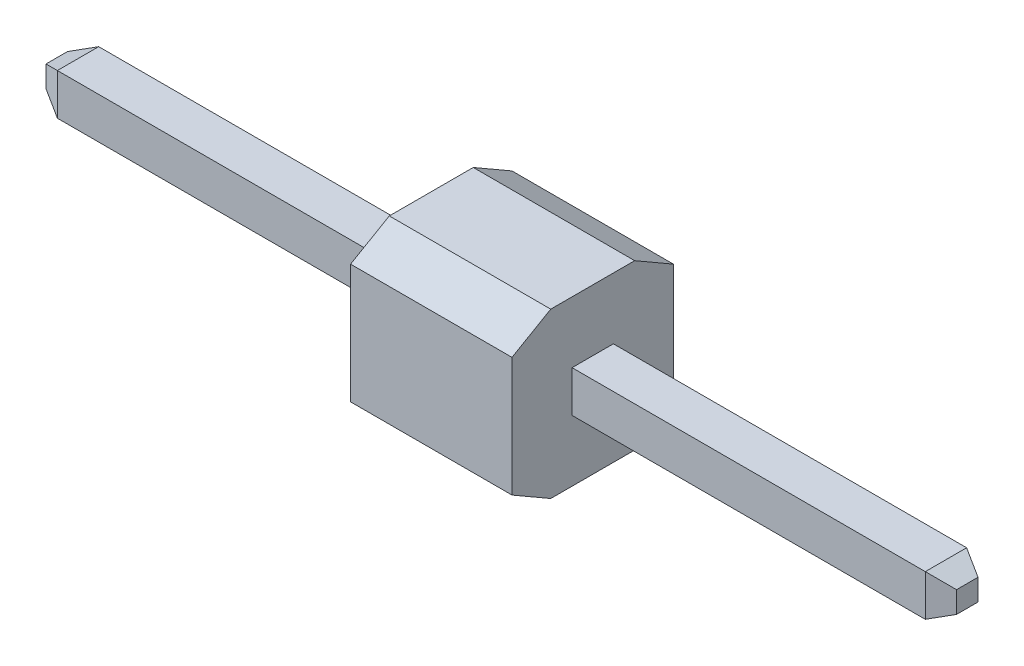
ISO-10303-21;
HEADER;
FILE_DESCRIPTION(('STEP AP214'),'2;1');
FILE_NAME('part.step','',(''),(''),'','','');
FILE_SCHEMA(('AUTOMOTIVE_DESIGN { 1 0 10303 214 1 1 1 1 }'));
ENDSEC;
DATA;
#1=APPLICATION_CONTEXT('core data for automotive mechanical design processes');
#2=APPLICATION_PROTOCOL_DEFINITION('international standard','automotive_design',2000,#1);
#3=PRODUCT_CONTEXT('',#1,'mechanical');
#4=PRODUCT('Part','Part','',(#3));
#5=PRODUCT_RELATED_PRODUCT_CATEGORY('part','',(#4));
#6=PRODUCT_DEFINITION_FORMATION('','',#4);
#7=PRODUCT_DEFINITION_CONTEXT('part definition',#1,'design');
#8=PRODUCT_DEFINITION('design','',#6,#7);
#9=PRODUCT_DEFINITION_SHAPE('','',#8);
#10=(LENGTH_UNIT() NAMED_UNIT(*) SI_UNIT(.MILLI.,.METRE.));
#11=(NAMED_UNIT(*) PLANE_ANGLE_UNIT() SI_UNIT($,.RADIAN.));
#12=(NAMED_UNIT(*) SI_UNIT($,.STERADIAN.) SOLID_ANGLE_UNIT());
#13=UNCERTAINTY_MEASURE_WITH_UNIT(LENGTH_MEASURE(1.E-05),#10,'distance_accuracy_value','');
#14=(GEOMETRIC_REPRESENTATION_CONTEXT(3) GLOBAL_UNCERTAINTY_ASSIGNED_CONTEXT((#13)) GLOBAL_UNIT_ASSIGNED_CONTEXT((#10,
#11,#12)) REPRESENTATION_CONTEXT('',''));
#15=CARTESIAN_POINT('',(0.,0.,0.));
#16=DIRECTION('',(0.,0.,1.));
#17=DIRECTION('',(1.,0.,0.));
#18=AXIS2_PLACEMENT_3D('',#15,#16,#17);
#19=CARTESIAN_POINT('',(5.42107483451908,2.22287173708609,0.629998634255617));
#20=DIRECTION('',(1.,4.37113882867379E-08,-4.37113882867379E-08));
#21=DIRECTION('',(-4.37113882867379E-08,1.,0.));
#22=AXIS2_PLACEMENT_3D('',#19,#20,#21);
#23=PLANE('',#22);
#24=DIRECTION('',(1.59994790123753E-08,0.500000000000193,0.866025403784327));
#25=VECTOR('',#24,1.);
#26=CARTESIAN_POINT('',(5.42107471153316,3.46646157557208,-0.940001365744382));
#27=LINE('',#26,#25);
#28=CARTESIAN_POINT('',(5.42107471153316,3.46646157557208,-0.940001365744382));
#29=VERTEX_POINT('',#28);
#30=CARTESIAN_POINT('',(5.42107472261793,3.81287173708609,-0.340001365744383));
#31=VERTEX_POINT('',#30);
#32=EDGE_CURVE('E11',#29,#31,#27,.T.);
#33=ORIENTED_EDGE('',*,*,#32,.T.);
#34=DIRECTION('',(4.37113880134522E-08,0.,0.999999999999999));
#35=VECTOR('',#34,1.);
#36=CARTESIAN_POINT('',(5.42107472261793,3.81287173708609,-0.340001365744383));
#37=LINE('',#36,#35);
#38=CARTESIAN_POINT('',(5.42107477944273,3.81287173708609,0.959998634255618));
#39=VERTEX_POINT('',#38);
#40=EDGE_CURVE('E304',#31,#39,#37,.T.);
#41=ORIENTED_EDGE('',*,*,#40,.T.);
#42=DIRECTION('',(5.97108668824037E-08,-0.500000000000186,0.866025403784329));
#43=VECTOR('',#42,1.);
#44=CARTESIAN_POINT('',(5.42107477944273,3.81287173708609,0.959998634255618));
#45=LINE('',#44,#43);
#46=CARTESIAN_POINT('',(5.42107482081163,3.46646157557209,1.55999863425562));
#47=VERTEX_POINT('',#46);
#48=EDGE_CURVE('E296',#39,#47,#45,.T.);
#49=ORIENTED_EDGE('',*,*,#48,.T.);
#50=DIRECTION('',(4.37113884816491E-08,-0.999999999999999,0.));
#51=VECTOR('',#50,1.);
#52=CARTESIAN_POINT('',(5.42107482081163,3.46646157557209,1.55999863425562));
#53=LINE('',#52,#51);
#54=CARTESIAN_POINT('',(5.42107490155442,1.61928189860609,1.55999863425562));
#55=VERTEX_POINT('',#54);
#56=EDGE_CURVE('E281',#47,#55,#53,.T.);
#57=ORIENTED_EDGE('',*,*,#56,.T.);
#58=DIRECTION('',(1.5999479012306E-08,0.500000000000192,0.866025403784328));
#59=VECTOR('',#58,1.);
#60=CARTESIAN_POINT('',(5.42107489046966,1.27287173708609,0.959998634255618));
#61=LINE('',#60,#59);
#62=CARTESIAN_POINT('',(5.42107489046966,1.27287173708609,0.959998634255618));
#63=VERTEX_POINT('',#62);
#64=EDGE_CURVE('E265',#63,#55,#61,.T.);
#65=ORIENTED_EDGE('',*,*,#64,.F.);
#66=DIRECTION('',(4.37113886966664E-08,0.,0.999999999999999));
#67=VECTOR('',#66,1.);
#68=CARTESIAN_POINT('',(5.42107483364485,1.27287173708609,-0.340001365744383));
#69=LINE('',#68,#67);
#70=CARTESIAN_POINT('',(5.42107483364485,1.27287173708609,-0.340001365744383));
#71=VERTEX_POINT('',#70);
#72=EDGE_CURVE('E248',#71,#63,#69,.T.);
#73=ORIENTED_EDGE('',*,*,#72,.F.);
#74=DIRECTION('',(5.971086560017E-08,-0.500000000000187,0.866025403784329));
#75=VECTOR('',#74,1.);
#76=CARTESIAN_POINT('',(5.42107479227595,1.61928189860608,-0.940001365744382));
#77=LINE('',#76,#75);
#78=CARTESIAN_POINT('',(5.42107479227595,1.61928189860608,-0.940001365744382));
#79=VERTEX_POINT('',#78);
#80=EDGE_CURVE('E242',#79,#71,#77,.T.);
#81=ORIENTED_EDGE('',*,*,#80,.F.);
#82=DIRECTION('',(4.37113884816491E-08,-0.999999999999999,0.));
#83=VECTOR('',#82,1.);
#84=CARTESIAN_POINT('',(5.42107471153316,3.46646157557208,-0.940001365744382));
#85=LINE('',#84,#83);
#86=EDGE_CURVE('E236',#29,#79,#85,.T.);
#87=ORIENTED_EDGE('',*,*,#86,.F.);
#88=EDGE_LOOP('',(#33,#41,#49,#57,#65,#73,#81,#87));
#89=FACE_BOUND('',#88,.T.);
#90=DIRECTION('',(-4.37113886753159E-08,0.,-0.999999999999999));
#91=VECTOR('',#90,1.);
#92=CARTESIAN_POINT('',(5.42107480654379,2.86287173708609,0.629998634255617));
#93=LINE('',#92,#91);
#94=CARTESIAN_POINT('',(5.42107480654379,2.86287173708609,0.629998634255617));
#95=VERTEX_POINT('',#94);
#96=CARTESIAN_POINT('',(5.4210747785685,2.86287173708609,-0.0100013657443826));
#97=VERTEX_POINT('',#96);
#98=EDGE_CURVE('E302',#95,#97,#93,.T.);
#99=ORIENTED_EDGE('',*,*,#98,.T.);
#100=DIRECTION('',(-4.37113886753159E-08,0.999999999999999,0.));
#101=VECTOR('',#100,1.);
#102=CARTESIAN_POINT('',(5.42107480654379,2.22287173708609,-0.0100013657443826));
#103=LINE('',#102,#101);
#104=CARTESIAN_POINT('',(5.42107480654379,2.22287173708609,-0.0100013657443826));
#105=VERTEX_POINT('',#104);
#106=EDGE_CURVE('E293',#105,#97,#103,.T.);
#107=ORIENTED_EDGE('',*,*,#106,.F.);
#108=DIRECTION('',(-4.37113886753159E-08,0.,-0.999999999999999));
#109=VECTOR('',#108,1.);
#110=CARTESIAN_POINT('',(5.42107483451908,2.22287173708609,0.629998634255617));
#111=LINE('',#110,#109);
#112=CARTESIAN_POINT('',(5.42107483451908,2.22287173708609,0.629998634255617));
#113=VERTEX_POINT('',#112);
#114=EDGE_CURVE('E278',#113,#105,#111,.T.);
#115=ORIENTED_EDGE('',*,*,#114,.F.);
#116=DIRECTION('',(-4.37113886753159E-08,0.999999999999999,0.));
#117=VECTOR('',#116,1.);
#118=CARTESIAN_POINT('',(5.42107483451908,2.22287173708609,0.629998634255617));
#119=LINE('',#118,#117);
#120=EDGE_CURVE('E263',#113,#95,#119,.T.);
#121=ORIENTED_EDGE('',*,*,#120,.T.);
#122=EDGE_LOOP('',(#99,#107,#115,#121));
#123=FACE_BOUND('',#122,.T.);
#124=ADVANCED_FACE('F17',(#89,#123),#23,.T.);
#125=CARTESIAN_POINT('',(2.92107483451908,2.22287162780762,0.629998743534088));
#126=DIRECTION('',(1.,4.37113882867379E-08,-4.37113882867379E-08));
#127=DIRECTION('',(-4.37113882867379E-08,1.,0.));
#128=AXIS2_PLACEMENT_3D('',#125,#126,#127);
#129=PLANE('',#128);
#130=DIRECTION('',(1.59994790123753E-08,0.500000000000193,0.866025403784327));
#131=VECTOR('',#130,1.);
#132=CARTESIAN_POINT('',(2.92107471153316,3.46646146629361,-0.940001256465912));
#133=LINE('',#132,#131);
#134=CARTESIAN_POINT('',(2.92107471153316,3.46646146629361,-0.940001256465912));
#135=VERTEX_POINT('',#134);
#136=CARTESIAN_POINT('',(2.92107472261793,3.81287162780762,-0.340001256465912));
#137=VERTEX_POINT('',#136);
#138=EDGE_CURVE('E24',#135,#137,#133,.T.);
#139=ORIENTED_EDGE('',*,*,#138,.F.);
#140=DIRECTION('',(4.37113884816491E-08,-0.999999999999999,0.));
#141=VECTOR('',#140,1.);
#142=CARTESIAN_POINT('',(2.92107471153316,3.46646146629361,-0.940001256465912));
#143=LINE('',#142,#141);
#144=CARTESIAN_POINT('',(2.92107479227595,1.61928178932761,-0.940001256465912));
#145=VERTEX_POINT('',#144);
#146=EDGE_CURVE('E300',#135,#145,#143,.T.);
#147=ORIENTED_EDGE('',*,*,#146,.T.);
#148=DIRECTION('',(5.97108662411576E-08,-0.500000000000187,0.866025403784329));
#149=VECTOR('',#148,1.);
#150=CARTESIAN_POINT('',(2.92107479227595,1.61928178932761,-0.940001256465912));
#151=LINE('',#150,#149);
#152=CARTESIAN_POINT('',(2.92107483364485,1.27287162780762,-0.340001256465912));
#153=VERTEX_POINT('',#152);
#154=EDGE_CURVE('E286',#145,#153,#151,.T.);
#155=ORIENTED_EDGE('',*,*,#154,.T.);
#156=DIRECTION('',(4.37113883550593E-08,0.,0.999999999999999));
#157=VECTOR('',#156,1.);
#158=CARTESIAN_POINT('',(2.92107483364485,1.27287162780762,-0.340001256465912));
#159=LINE('',#158,#157);
#160=CARTESIAN_POINT('',(2.92107489046966,1.27287162780762,0.959998743534088));
#161=VERTEX_POINT('',#160);
#162=EDGE_CURVE('E271',#153,#161,#159,.T.);
#163=ORIENTED_EDGE('',*,*,#162,.T.);
#164=DIRECTION('',(1.5999479012306E-08,0.500000000000192,0.866025403784328));
#165=VECTOR('',#164,1.);
#166=CARTESIAN_POINT('',(2.92107489046966,1.27287162780762,0.959998743534088));
#167=LINE('',#166,#165);
#168=CARTESIAN_POINT('',(2.92107490155442,1.61928178932762,1.55999874353409));
#169=VERTEX_POINT('',#168);
#170=EDGE_CURVE('E253',#161,#169,#167,.T.);
#171=ORIENTED_EDGE('',*,*,#170,.T.);
#172=DIRECTION('',(4.37113884816491E-08,-0.999999999999999,0.));
#173=VECTOR('',#172,1.);
#174=CARTESIAN_POINT('',(2.92107482081163,3.46646146629362,1.55999874353409));
#175=LINE('',#174,#173);
#176=CARTESIAN_POINT('',(2.92107482081163,3.46646146629362,1.55999874353409));
#177=VERTEX_POINT('',#176);
#178=EDGE_CURVE('E261',#177,#169,#175,.T.);
#179=ORIENTED_EDGE('',*,*,#178,.F.);
#180=DIRECTION('',(5.97108668824037E-08,-0.500000000000186,0.866025403784329));
#181=VECTOR('',#180,1.);
#182=CARTESIAN_POINT('',(2.92107477944273,3.81287162780762,0.959998743534088));
#183=LINE('',#182,#181);
#184=CARTESIAN_POINT('',(2.92107477944273,3.81287162780762,0.959998743534088));
#185=VERTEX_POINT('',#184);
#186=EDGE_CURVE('E276',#185,#177,#183,.T.);
#187=ORIENTED_EDGE('',*,*,#186,.F.);
#188=DIRECTION('',(4.37113880134522E-08,0.,0.999999999999999));
#189=VECTOR('',#188,1.);
#190=CARTESIAN_POINT('',(2.92107472261793,3.81287162780762,-0.340001256465912));
#191=LINE('',#190,#189);
#192=EDGE_CURVE('E291',#137,#185,#191,.T.);
#193=ORIENTED_EDGE('',*,*,#192,.F.);
#194=EDGE_LOOP('',(#139,#147,#155,#163,#171,#179,#187,#193));
#195=FACE_BOUND('',#194,.T.);
#196=DIRECTION('',(-4.37113886753159E-08,0.999999999999999,0.));
#197=VECTOR('',#196,1.);
#198=CARTESIAN_POINT('',(2.92107480654379,2.22287162780762,-0.0100012564659119));
#199=LINE('',#198,#197);
#200=CARTESIAN_POINT('',(2.92107480654379,2.22287162780762,-0.0100012564659119));
#201=VERTEX_POINT('',#200);
#202=CARTESIAN_POINT('',(2.9210747785685,2.86287162780762,-0.0100012564659119));
#203=VERTEX_POINT('',#202);
#204=EDGE_CURVE('E298',#201,#203,#199,.T.);
#205=ORIENTED_EDGE('',*,*,#204,.T.);
#206=DIRECTION('',(-4.37113886753159E-08,0.,-0.999999999999999));
#207=VECTOR('',#206,1.);
#208=CARTESIAN_POINT('',(2.92107480654379,2.86287162780762,0.629998743534088));
#209=LINE('',#208,#207);
#210=CARTESIAN_POINT('',(2.92107480654379,2.86287162780762,0.629998743534088));
#211=VERTEX_POINT('',#210);
#212=EDGE_CURVE('E283',#211,#203,#209,.T.);
#213=ORIENTED_EDGE('',*,*,#212,.F.);
#214=DIRECTION('',(-4.37113879814265E-08,0.999999999999999,0.));
#215=VECTOR('',#214,1.);
#216=CARTESIAN_POINT('',(2.92107483451908,2.22287162780762,0.629998743534088));
#217=LINE('',#216,#215);
#218=CARTESIAN_POINT('',(2.92107483451908,2.22287162780762,0.629998743534088));
#219=VERTEX_POINT('',#218);
#220=EDGE_CURVE('E268',#219,#211,#217,.T.);
#221=ORIENTED_EDGE('',*,*,#220,.F.);
#222=DIRECTION('',(-4.37113879814266E-08,0.,-0.999999999999999));
#223=VECTOR('',#222,1.);
#224=CARTESIAN_POINT('',(2.92107483451908,2.22287162780762,0.629998743534088));
#225=LINE('',#224,#223);
#226=EDGE_CURVE('E251',#219,#201,#225,.T.);
#227=ORIENTED_EDGE('',*,*,#226,.T.);
#228=EDGE_LOOP('',(#205,#213,#221,#227));
#229=FACE_BOUND('',#228,.T.);
#230=ADVANCED_FACE('F314',(#195,#229),#129,.F.);
#231=CARTESIAN_POINT('',(5.42107471153316,3.46646157557208,-0.940001365744382));
#232=DIRECTION('',(5.97108668343731E-08,-0.866025403784328,0.50000000000019));
#233=DIRECTION('',(-1.59994785476185E-08,-0.500000000000192,-0.866025403784329));
#234=AXIS2_PLACEMENT_3D('',#231,#232,#233);
#235=PLANE('',#234);
#236=ORIENTED_EDGE('',*,*,#138,.T.);
#237=DIRECTION('',(-0.999999999999998,-4.37113882867378E-08,4.37113883755557E-08));
#238=VECTOR('',#237,1.);
#239=CARTESIAN_POINT('',(5.42107472261793,3.81287173708609,-0.340001365744383));
#240=LINE('',#239,#238);
#241=EDGE_CURVE('E288',#31,#137,#240,.T.);
#242=ORIENTED_EDGE('',*,*,#241,.F.);
#243=ORIENTED_EDGE('',*,*,#32,.F.);
#244=DIRECTION('',(-0.999999999999998,-4.37113889972806E-08,4.37113881091022E-08));
#245=VECTOR('',#244,1.);
#246=CARTESIAN_POINT('',(5.42107471153316,3.46646157557208,-0.940001365744382));
#247=LINE('',#246,#245);
#248=EDGE_CURVE('E256',#29,#135,#247,.T.);
#249=ORIENTED_EDGE('',*,*,#248,.T.);
#250=EDGE_LOOP('',(#236,#242,#243,#249));
#251=FACE_BOUND('',#250,.T.);
#252=ADVANCED_FACE('F306',(#251),#235,.F.);
#253=CARTESIAN_POINT('',(5.42107472261793,3.81287173708609,-0.340001365744383));
#254=DIRECTION('',(4.37113882867379E-08,-1.,0.));
#255=DIRECTION('',(1.,4.37113882867379E-08,-4.37113882867379E-08));
#256=AXIS2_PLACEMENT_3D('',#253,#254,#255);
#257=PLANE('',#256);
#258=ORIENTED_EDGE('',*,*,#192,.T.);
#259=DIRECTION('',(-0.999999999999998,-4.37113882867378E-08,4.37113882867378E-08));
#260=VECTOR('',#259,1.);
#261=CARTESIAN_POINT('',(5.42107477944273,3.81287173708609,0.959998634255618));
#262=LINE('',#261,#260);
#263=EDGE_CURVE('E273',#39,#185,#262,.T.);
#264=ORIENTED_EDGE('',*,*,#263,.F.);
#265=ORIENTED_EDGE('',*,*,#40,.F.);
#266=ORIENTED_EDGE('',*,*,#241,.T.);
#267=EDGE_LOOP('',(#258,#264,#265,#266));
#268=FACE_BOUND('',#267,.T.);
#269=ADVANCED_FACE('F311',(#268),#257,.F.);
#270=CARTESIAN_POINT('',(5.42107477944273,3.81287173708609,0.959998634255618));
#271=DIRECTION('',(1.59994785476185E-08,-0.86602540378433,-0.50000000000019));
#272=DIRECTION('',(-5.97108668343731E-08,0.500000000000188,-0.866025403784329));
#273=AXIS2_PLACEMENT_3D('',#270,#271,#272);
#274=PLANE('',#273);
#275=ORIENTED_EDGE('',*,*,#186,.T.);
#276=DIRECTION('',(-0.999999999999998,-4.37113889972806E-08,4.37113882867378E-08));
#277=VECTOR('',#276,1.);
#278=CARTESIAN_POINT('',(5.42107482081163,3.46646157557209,1.55999863425562));
#279=LINE('',#278,#277);
#280=EDGE_CURVE('E258',#47,#177,#279,.T.);
#281=ORIENTED_EDGE('',*,*,#280,.F.);
#282=ORIENTED_EDGE('',*,*,#48,.F.);
#283=ORIENTED_EDGE('',*,*,#263,.T.);
#284=EDGE_LOOP('',(#275,#281,#282,#283));
#285=FACE_BOUND('',#284,.T.);
#286=ADVANCED_FACE('F319',(#285),#274,.F.);
#287=CARTESIAN_POINT('',(5.42107482081163,3.46646157557209,1.55999863425562));
#288=DIRECTION('',(-4.37113882867379E-08,0.,-1.));
#289=DIRECTION('',(-1.,-4.37113882867379E-08,4.37113882867379E-08));
#290=AXIS2_PLACEMENT_3D('',#287,#288,#289);
#291=PLANE('',#290);
#292=ORIENTED_EDGE('',*,*,#178,.T.);
#293=DIRECTION('',(-0.999999999999998,-4.37113889972806E-08,4.37113882867378E-08));
#294=VECTOR('',#293,1.);
#295=CARTESIAN_POINT('',(5.42107490155442,1.61928189860609,1.55999863425562));
#296=LINE('',#295,#294);
#297=EDGE_CURVE('E245',#55,#169,#296,.T.);
#298=ORIENTED_EDGE('',*,*,#297,.F.);
#299=ORIENTED_EDGE('',*,*,#56,.F.);
#300=ORIENTED_EDGE('',*,*,#280,.T.);
#301=EDGE_LOOP('',(#292,#298,#299,#300));
#302=FACE_BOUND('',#301,.T.);
#303=ADVANCED_FACE('F326',(#302),#291,.F.);
#304=CARTESIAN_POINT('',(5.42107489046966,1.27287173708609,0.959998634255618));
#305=DIRECTION('',(5.97108668343731E-08,-0.866025403784328,0.50000000000019));
#306=DIRECTION('',(-1.59994785476185E-08,-0.500000000000192,-0.866025403784329));
#307=AXIS2_PLACEMENT_3D('',#304,#305,#306);
#308=PLANE('',#307);
#309=ORIENTED_EDGE('',*,*,#170,.F.);
#310=DIRECTION('',(-0.999999999999998,-4.37113882867378E-08,4.37113882867378E-08));
#311=VECTOR('',#310,1.);
#312=CARTESIAN_POINT('',(5.42107489046966,1.27287173708609,0.959998634255618));
#313=LINE('',#312,#311);
#314=EDGE_CURVE('E239',#63,#161,#313,.T.);
#315=ORIENTED_EDGE('',*,*,#314,.F.);
#316=ORIENTED_EDGE('',*,*,#64,.T.);
#317=ORIENTED_EDGE('',*,*,#297,.T.);
#318=EDGE_LOOP('',(#309,#315,#316,#317));
#319=FACE_BOUND('',#318,.T.);
#320=ADVANCED_FACE('F329',(#319),#308,.T.);
#321=CARTESIAN_POINT('',(5.42107483364485,1.27287173708609,-0.340001365744383));
#322=DIRECTION('',(4.37113882867379E-08,-1.,0.));
#323=DIRECTION('',(1.,4.37113882867379E-08,-4.37113882867379E-08));
#324=AXIS2_PLACEMENT_3D('',#321,#322,#323);
#325=PLANE('',#324);
#326=ORIENTED_EDGE('',*,*,#162,.F.);
#327=DIRECTION('',(-0.999999999999998,-4.37113882867378E-08,4.37113883755557E-08));
#328=VECTOR('',#327,1.);
#329=CARTESIAN_POINT('',(5.42107483364485,1.27287173708609,-0.340001365744383));
#330=LINE('',#329,#328);
#331=EDGE_CURVE('E233',#71,#153,#330,.T.);
#332=ORIENTED_EDGE('',*,*,#331,.F.);
#333=ORIENTED_EDGE('',*,*,#72,.T.);
#334=ORIENTED_EDGE('',*,*,#314,.T.);
#335=EDGE_LOOP('',(#326,#332,#333,#334));
#336=FACE_BOUND('',#335,.T.);
#337=ADVANCED_FACE('F333',(#336),#325,.T.);
#338=CARTESIAN_POINT('',(5.42107479227595,1.61928189860608,-0.940001365744382));
#339=DIRECTION('',(1.59994785476185E-08,-0.86602540378433,-0.50000000000019));
#340=DIRECTION('',(-5.97108668343731E-08,0.500000000000188,-0.866025403784329));
#341=AXIS2_PLACEMENT_3D('',#338,#339,#340);
#342=PLANE('',#341);
#343=ORIENTED_EDGE('',*,*,#154,.F.);
#344=DIRECTION('',(-0.999999999999998,-4.37113889972806E-08,4.37113881091022E-08));
#345=VECTOR('',#344,1.);
#346=CARTESIAN_POINT('',(5.42107479227595,1.61928189860608,-0.940001365744382));
#347=LINE('',#346,#345);
#348=EDGE_CURVE('E230',#79,#145,#347,.T.);
#349=ORIENTED_EDGE('',*,*,#348,.F.);
#350=ORIENTED_EDGE('',*,*,#80,.T.);
#351=ORIENTED_EDGE('',*,*,#331,.T.);
#352=EDGE_LOOP('',(#343,#349,#350,#351));
#353=FACE_BOUND('',#352,.T.);
#354=ADVANCED_FACE('F337',(#353),#342,.T.);
#355=CARTESIAN_POINT('',(5.42107471153316,3.46646157557208,-0.940001365744382));
#356=DIRECTION('',(-4.37113882867379E-08,0.,-1.));
#357=DIRECTION('',(-4.37113882867379E-08,1.,0.));
#358=AXIS2_PLACEMENT_3D('',#355,#356,#357);
#359=PLANE('',#358);
#360=ORIENTED_EDGE('',*,*,#146,.F.);
#361=ORIENTED_EDGE('',*,*,#248,.F.);
#362=ORIENTED_EDGE('',*,*,#86,.T.);
#363=ORIENTED_EDGE('',*,*,#348,.T.);
#364=EDGE_LOOP('',(#360,#361,#362,#363));
#365=FACE_BOUND('',#364,.T.);
#366=ADVANCED_FACE('F339',(#365),#359,.T.);
#367=CARTESIAN_POINT('',(-2.87892516548092,2.22287137428157,0.62999899706014));
#368=DIRECTION('',(-1.,-4.37113882867379E-08,4.37113882867379E-08));
#369=DIRECTION('',(4.37113882867379E-08,-1.,0.));
#370=AXIS2_PLACEMENT_3D('',#367,#368,#369);
#371=PLANE('',#370);
#372=DIRECTION('',(4.37113847292273E-08,-0.999999999999999,0.));
#373=VECTOR('',#372,1.);
#374=CARTESIAN_POINT('',(-2.87892520797874,2.70898984709056,0.14388052425114));
#375=LINE('',#374,#373);
#376=CARTESIAN_POINT('',(-2.87892520797874,2.70898984709056,0.14388052425114));
#377=VERTEX_POINT('',#376);
#378=CARTESIAN_POINT('',(-2.87892519345621,2.37675290148156,0.14388052425114));
#379=VERTEX_POINT('',#378);
#380=EDGE_CURVE('E228',#377,#379,#375,.T.);
#381=ORIENTED_EDGE('',*,*,#380,.T.);
#382=DIRECTION('',(4.37113874013716E-08,0.,0.999999999999999));
#383=VECTOR('',#382,1.);
#384=CARTESIAN_POINT('',(-2.87892519345621,2.37675290148156,0.14388052425114));
#385=LINE('',#384,#383);
#386=CARTESIAN_POINT('',(-2.87892517893367,2.37675290148156,0.47611746986914));
#387=VERTEX_POINT('',#386);
#388=EDGE_CURVE('E223',#379,#387,#385,.T.);
#389=ORIENTED_EDGE('',*,*,#388,.T.);
#390=DIRECTION('',(-4.37113900758839E-08,0.999999999999999,0.));
#391=VECTOR('',#390,1.);
#392=CARTESIAN_POINT('',(-2.87892517893367,2.37675290148156,0.47611746986914));
#393=LINE('',#392,#391);
#394=CARTESIAN_POINT('',(-2.87892519345621,2.70898984709057,0.47611746986914));
#395=VERTEX_POINT('',#394);
#396=EDGE_CURVE('E215',#387,#395,#393,.T.);
#397=ORIENTED_EDGE('',*,*,#396,.T.);
#398=DIRECTION('',(-4.37113820547151E-08,0.,-0.999999999999999));
#399=VECTOR('',#398,1.);
#400=CARTESIAN_POINT('',(-2.87892519345621,2.70898984709057,0.47611746986914));
#401=LINE('',#400,#399);
#402=EDGE_CURVE('E207',#395,#377,#401,.T.);
#403=ORIENTED_EDGE('',*,*,#402,.T.);
#404=EDGE_LOOP('',(#381,#389,#397,#403));
#405=FACE_BOUND('',#404,.T.);
#406=ADVANCED_FACE('F341',(#405),#371,.T.);
#407=CARTESIAN_POINT('',(-2.87892516548092,2.22287137428157,0.62999899706014));
#408=DIRECTION('',(4.37113882867379E-08,-1.,0.));
#409=DIRECTION('',(-4.37113882867379E-08,0.,-1.));
#410=AXIS2_PLACEMENT_3D('',#407,#408,#409);
#411=PLANE('',#410);
#412=DIRECTION('',(0.999999999999998,4.37113888452998E-08,-4.37113882769955E-08));
#413=VECTOR('',#412,1.);
#414=CARTESIAN_POINT('',(-2.54892516548092,2.22287138870632,0.629998982635382));
#415=LINE('',#414,#413);
#416=CARTESIAN_POINT('',(-2.54892516548092,2.22287138870632,0.629998982635382));
#417=VERTEX_POINT('',#416);
#418=EDGE_CURVE('E225',#417,#219,#415,.T.);
#419=ORIENTED_EDGE('',*,*,#418,.F.);
#420=DIRECTION('',(-4.37113886753159E-08,0.,-0.999999999999999));
#421=VECTOR('',#420,1.);
#422=CARTESIAN_POINT('',(-2.54892516548092,2.22287138870632,0.629998982635382));
#423=LINE('',#422,#421);
#424=CARTESIAN_POINT('',(-2.54892519345621,2.22287138870632,-0.010001017364618));
#425=VERTEX_POINT('',#424);
#426=EDGE_CURVE('E217',#417,#425,#423,.T.);
#427=ORIENTED_EDGE('',*,*,#426,.T.);
#428=DIRECTION('',(0.999999999999998,4.37113888452998E-08,-4.37113882161057E-08));
#429=VECTOR('',#428,1.);
#430=CARTESIAN_POINT('',(-2.54892519345621,2.22287138870632,-0.010001017364618));
#431=LINE('',#430,#429);
#432=EDGE_CURVE('E220',#425,#201,#431,.T.);
#433=ORIENTED_EDGE('',*,*,#432,.T.);
#434=ORIENTED_EDGE('',*,*,#226,.F.);
#435=EDGE_LOOP('',(#419,#427,#433,#434));
#436=FACE_BOUND('',#435,.T.);
#437=ADVANCED_FACE('F348',(#436),#411,.T.);
#438=CARTESIAN_POINT('',(-2.87892519345621,2.22287137428156,-0.0100010029398598));
#439=DIRECTION('',(-4.37113882867379E-08,0.,-1.));
#440=DIRECTION('',(-1.,-4.37113882867379E-08,4.37113882867379E-08));
#441=AXIS2_PLACEMENT_3D('',#438,#439,#440);
#442=PLANE('',#441);
#443=ORIENTED_EDGE('',*,*,#432,.F.);
#444=DIRECTION('',(-4.37113886753159E-08,0.999999999999999,0.));
#445=VECTOR('',#444,1.);
#446=CARTESIAN_POINT('',(-2.54892519345621,2.22287138870632,-0.010001017364618));
#447=LINE('',#446,#445);
#448=CARTESIAN_POINT('',(-2.5489252214315,2.86287138870632,-0.010001017364618));
#449=VERTEX_POINT('',#448);
#450=EDGE_CURVE('E209',#425,#449,#447,.T.);
#451=ORIENTED_EDGE('',*,*,#450,.T.);
#452=DIRECTION('',(0.999999999999998,4.37113888452998E-08,-4.37113882161057E-08));
#453=VECTOR('',#452,1.);
#454=CARTESIAN_POINT('',(-2.5489252214315,2.86287138870632,-0.010001017364618));
#455=LINE('',#454,#453);
#456=EDGE_CURVE('E212',#449,#203,#455,.T.);
#457=ORIENTED_EDGE('',*,*,#456,.T.);
#458=ORIENTED_EDGE('',*,*,#204,.F.);
#459=EDGE_LOOP('',(#443,#451,#457,#458));
#460=FACE_BOUND('',#459,.T.);
#461=ADVANCED_FACE('F424',(#460),#442,.T.);
#462=CARTESIAN_POINT('',(-2.87892519345621,2.86287137428157,0.62999899706014));
#463=DIRECTION('',(4.37113882867379E-08,-1.,0.));
#464=DIRECTION('',(-4.37113882867379E-08,0.,-1.));
#465=AXIS2_PLACEMENT_3D('',#462,#463,#464);
#466=PLANE('',#465);
#467=ORIENTED_EDGE('',*,*,#456,.F.);
#468=DIRECTION('',(4.37113900630947E-08,0.,0.999999999999999));
#469=VECTOR('',#468,1.);
#470=CARTESIAN_POINT('',(-2.5489252214315,2.86287138870632,-0.010001017364618));
#471=LINE('',#470,#469);
#472=CARTESIAN_POINT('',(-2.54892519345621,2.86287138870632,0.629998982635382));
#473=VERTEX_POINT('',#472);
#474=EDGE_CURVE('E201',#449,#473,#471,.T.);
#475=ORIENTED_EDGE('',*,*,#474,.T.);
#476=DIRECTION('',(0.999999999999998,4.37113888452998E-08,-4.37113882769955E-08));
#477=VECTOR('',#476,1.);
#478=CARTESIAN_POINT('',(-2.54892519345621,2.86287138870632,0.629998982635382));
#479=LINE('',#478,#477);
#480=EDGE_CURVE('E204',#473,#211,#479,.T.);
#481=ORIENTED_EDGE('',*,*,#480,.T.);
#482=ORIENTED_EDGE('',*,*,#212,.T.);
#483=EDGE_LOOP('',(#467,#475,#481,#482));
#484=FACE_BOUND('',#483,.T.);
#485=ADVANCED_FACE('F421',(#484),#466,.F.);
#486=CARTESIAN_POINT('',(-2.87892516548092,2.22287137428157,0.62999899706014));
#487=DIRECTION('',(-4.37113882867379E-08,0.,-1.));
#488=DIRECTION('',(-1.,-4.37113882867379E-08,4.37113882867379E-08));
#489=AXIS2_PLACEMENT_3D('',#486,#487,#488);
#490=PLANE('',#489);
#491=ORIENTED_EDGE('',*,*,#480,.F.);
#492=DIRECTION('',(4.37113872875371E-08,-0.999999999999999,0.));
#493=VECTOR('',#492,1.);
#494=CARTESIAN_POINT('',(-2.54892519345621,2.86287138870632,0.629998982635382));
#495=LINE('',#494,#493);
#496=EDGE_CURVE('E196',#473,#417,#495,.T.);
#497=ORIENTED_EDGE('',*,*,#496,.T.);
#498=ORIENTED_EDGE('',*,*,#418,.T.);
#499=ORIENTED_EDGE('',*,*,#220,.T.);
#500=EDGE_LOOP('',(#491,#497,#498,#499));
#501=FACE_BOUND('',#500,.T.);
#502=ADVANCED_FACE('F376',(#501),#490,.F.);
#503=CARTESIAN_POINT('',(-2.87892516548092,2.22287137428157,0.62999899706014));
#504=DIRECTION('',(-4.37113882867379E-08,0.,-1.));
#505=DIRECTION('',(-1.,-4.37113882867379E-08,4.37113882867379E-08));
#506=AXIS2_PLACEMENT_3D('',#503,#504,#505);
#507=PLANE('',#506);
#508=DIRECTION('',(0.999999999999998,4.37113881958092E-08,-4.37113882769955E-08));
#509=VECTOR('',#508,1.);
#510=CARTESIAN_POINT('',(5.42107483451908,2.22287173708609,0.629998634255617));
#511=LINE('',#510,#509);
#512=CARTESIAN_POINT('',(10.8910748345191,2.22287197618738,0.629998395154324));
#513=VERTEX_POINT('',#512);
#514=EDGE_CURVE('E199',#113,#513,#511,.T.);
#515=ORIENTED_EDGE('',*,*,#514,.T.);
#516=DIRECTION('',(-4.37113900630947E-08,0.999999999999999,0.));
#517=VECTOR('',#516,1.);
#518=CARTESIAN_POINT('',(10.8910748345191,2.22287197618738,0.629998395154324));
#519=LINE('',#518,#517);
#520=CARTESIAN_POINT('',(10.8910748065438,2.86287197618738,0.629998395154324));
#521=VERTEX_POINT('',#520);
#522=EDGE_CURVE('E191',#513,#521,#519,.T.);
#523=ORIENTED_EDGE('',*,*,#522,.T.);
#524=DIRECTION('',(0.999999999999998,4.37113881958092E-08,-4.37113882769955E-08));
#525=VECTOR('',#524,1.);
#526=CARTESIAN_POINT('',(5.42107480654379,2.86287173708609,0.629998634255617));
#527=LINE('',#526,#525);
#528=EDGE_CURVE('E194',#95,#521,#527,.T.);
#529=ORIENTED_EDGE('',*,*,#528,.F.);
#530=ORIENTED_EDGE('',*,*,#120,.F.);
#531=EDGE_LOOP('',(#515,#523,#529,#530));
#532=FACE_BOUND('',#531,.T.);
#533=ADVANCED_FACE('F367',(#532),#507,.F.);
#534=CARTESIAN_POINT('',(-2.87892519345621,2.86287137428157,0.62999899706014));
#535=DIRECTION('',(4.37113882867379E-08,-1.,0.));
#536=DIRECTION('',(-4.37113882867379E-08,0.,-1.));
#537=AXIS2_PLACEMENT_3D('',#534,#535,#536);
#538=PLANE('',#537);
#539=ORIENTED_EDGE('',*,*,#528,.T.);
#540=DIRECTION('',(-4.37113900630947E-08,0.,-0.999999999999999));
#541=VECTOR('',#540,1.);
#542=CARTESIAN_POINT('',(10.8910748065438,2.86287197618738,0.629998395154324));
#543=LINE('',#542,#541);
#544=CARTESIAN_POINT('',(10.8910747785685,2.86287197618738,-0.0100016048456765));
#545=VERTEX_POINT('',#544);
#546=EDGE_CURVE('E186',#521,#545,#543,.T.);
#547=ORIENTED_EDGE('',*,*,#546,.T.);
#548=DIRECTION('',(0.999999999999998,4.37113881958092E-08,-4.37113881146228E-08));
#549=VECTOR('',#548,1.);
#550=CARTESIAN_POINT('',(5.4210747785685,2.86287173708609,-0.0100013657443823));
#551=LINE('',#550,#549);
#552=EDGE_CURVE('E189',#97,#545,#551,.T.);
#553=ORIENTED_EDGE('',*,*,#552,.F.);
#554=ORIENTED_EDGE('',*,*,#98,.F.);
#555=EDGE_LOOP('',(#539,#547,#553,#554));
#556=FACE_BOUND('',#555,.T.);
#557=ADVANCED_FACE('F364',(#556),#538,.F.);
#558=CARTESIAN_POINT('',(-2.87892519345621,2.22287137428156,-0.0100010029398598));
#559=DIRECTION('',(-4.37113882867379E-08,0.,-1.));
#560=DIRECTION('',(-1.,-4.37113882867379E-08,4.37113882867379E-08));
#561=AXIS2_PLACEMENT_3D('',#558,#559,#560);
#562=PLANE('',#561);
#563=ORIENTED_EDGE('',*,*,#552,.T.);
#564=DIRECTION('',(4.37113872875371E-08,-0.999999999999999,0.));
#565=VECTOR('',#564,1.);
#566=CARTESIAN_POINT('',(10.8910747785685,2.86287197618738,-0.0100016048456764));
#567=LINE('',#566,#565);
#568=CARTESIAN_POINT('',(10.8910748065438,2.22287197618738,-0.0100016048456765));
#569=VERTEX_POINT('',#568);
#570=EDGE_CURVE('E176',#545,#569,#567,.T.);
#571=ORIENTED_EDGE('',*,*,#570,.T.);
#572=DIRECTION('',(0.999999999999998,4.37113881958092E-08,-4.37113881146228E-08));
#573=VECTOR('',#572,1.);
#574=CARTESIAN_POINT('',(5.42107480654379,2.22287173708609,-0.0100013657443823));
#575=LINE('',#574,#573);
#576=EDGE_CURVE('E179',#105,#569,#575,.T.);
#577=ORIENTED_EDGE('',*,*,#576,.F.);
#578=ORIENTED_EDGE('',*,*,#106,.T.);
#579=EDGE_LOOP('',(#563,#571,#577,#578));
#580=FACE_BOUND('',#579,.T.);
#581=ADVANCED_FACE('F366',(#580),#562,.T.);
#582=CARTESIAN_POINT('',(-2.87892516548092,2.22287137428157,0.62999899706014));
#583=DIRECTION('',(4.37113882867379E-08,-1.,0.));
#584=DIRECTION('',(-4.37113882867379E-08,0.,-1.));
#585=AXIS2_PLACEMENT_3D('',#582,#583,#584);
#586=PLANE('',#585);
#587=ORIENTED_EDGE('',*,*,#576,.T.);
#588=DIRECTION('',(4.37113845119796E-08,0.,0.999999999999999));
#589=VECTOR('',#588,1.);
#590=CARTESIAN_POINT('',(10.8910748065438,2.22287197618738,-0.0100016048456765));
#591=LINE('',#590,#589);
#592=EDGE_CURVE('E167',#569,#513,#591,.T.);
#593=ORIENTED_EDGE('',*,*,#592,.T.);
#594=ORIENTED_EDGE('',*,*,#514,.F.);
#595=ORIENTED_EDGE('',*,*,#114,.T.);
#596=EDGE_LOOP('',(#587,#593,#594,#595));
#597=FACE_BOUND('',#596,.T.);
#598=ADVANCED_FACE('F373',(#597),#586,.T.);
#599=CARTESIAN_POINT('',(11.2210748345191,2.22287199061214,0.629998380729565));
#600=DIRECTION('',(-1.,-4.37113882867379E-08,4.37113882867379E-08));
#601=DIRECTION('',(4.37113882867379E-08,-1.,0.));
#602=AXIS2_PLACEMENT_3D('',#599,#600,#601);
#603=PLANE('',#602);
#604=DIRECTION('',(-4.37113874025556E-08,0.999999999999999,0.));
#605=VECTOR('',#604,1.);
#606=CARTESIAN_POINT('',(11.2210748065438,2.37675351781214,0.143879907920565));
#607=LINE('',#606,#605);
#608=CARTESIAN_POINT('',(11.2210748065438,2.37675351781214,0.143879907920565));
#609=VERTEX_POINT('',#608);
#610=CARTESIAN_POINT('',(11.2210747920213,2.70899046342114,0.143879907920565));
#611=VERTEX_POINT('',#610);
#612=EDGE_CURVE('E153',#609,#611,#607,.T.);
#613=ORIENTED_EDGE('',*,*,#612,.T.);
#614=DIRECTION('',(4.37113874013716E-08,0.,0.999999999999999));
#615=VECTOR('',#614,1.);
#616=CARTESIAN_POINT('',(11.2210747920213,2.70899046342114,0.143879907920565));
#617=LINE('',#616,#615);
#618=CARTESIAN_POINT('',(11.2210748065438,2.70899046342114,0.476116853538565));
#619=VERTEX_POINT('',#618);
#620=EDGE_CURVE('E395',#611,#619,#617,.T.);
#621=ORIENTED_EDGE('',*,*,#620,.T.);
#622=DIRECTION('',(4.37113927492122E-08,-0.999999999999999,0.));
#623=VECTOR('',#622,1.);
#624=CARTESIAN_POINT('',(11.2210748065438,2.70899046342114,0.476116853538565));
#625=LINE('',#624,#623);
#626=CARTESIAN_POINT('',(11.2210748210663,2.37675351781214,0.476116853538565));
#627=VERTEX_POINT('',#626);
#628=EDGE_CURVE('E156',#619,#627,#625,.T.);
#629=ORIENTED_EDGE('',*,*,#628,.T.);
#630=DIRECTION('',(-4.37113980946847E-08,0.,-0.999999999999999));
#631=VECTOR('',#630,1.);
#632=CARTESIAN_POINT('',(11.2210748210663,2.37675351781214,0.476116853538565));
#633=LINE('',#632,#631);
#634=EDGE_CURVE('E149',#627,#609,#633,.T.);
#635=ORIENTED_EDGE('',*,*,#634,.T.);
#636=EDGE_LOOP('',(#613,#621,#629,#635));
#637=FACE_BOUND('',#636,.T.);
#638=ADVANCED_FACE('F151',(#637),#603,.F.);
#639=CARTESIAN_POINT('',(-2.87892518672983,2.70898984709057,0.62999899706014));
#640=DIRECTION('',(-0.422618301356784,0.906307768563367,1.84732310895534E-08));
#641=DIRECTION('',(4.37113882867379E-08,0.,1.));
#642=AXIS2_PLACEMENT_3D('',#639,#640,#641);
#643=PLANE('',#642);
#644=DIRECTION('',(0.834817095446926,0.389281657126019,-0.389281657126018));
#645=VECTOR('',#644,1.);
#646=CARTESIAN_POINT('',(-2.87892520797844,2.70898984709023,0.143880524251471));
#647=LINE('',#646,#645);
#648=EDGE_CURVE('E181',#377,#449,#647,.T.);
#649=ORIENTED_EDGE('',*,*,#648,.F.);
#650=ORIENTED_EDGE('',*,*,#402,.F.);
#651=DIRECTION('',(-0.834817129479006,-0.38928165712602,-0.389281584143987));
#652=VECTOR('',#651,1.);
#653=CARTESIAN_POINT('',(-2.54892519345599,2.86287138870609,0.629998982635147));
#654=LINE('',#653,#652);
#655=EDGE_CURVE('E404',#473,#395,#654,.T.);
#656=ORIENTED_EDGE('',*,*,#655,.F.);
#657=ORIENTED_EDGE('',*,*,#474,.F.);
#658=EDGE_LOOP('',(#649,#650,#656,#657));
#659=FACE_BOUND('',#658,.T.);
#660=ADVANCED_FACE('F418',(#659),#643,.T.);
#661=CARTESIAN_POINT('',(-2.87892517220729,2.22287137428157,0.47611746986914));
#662=DIRECTION('',(-0.422618222124841,-1.84732292043498E-08,0.906307805509828));
#663=DIRECTION('',(4.37113882867379E-08,-1.,0.));
#664=AXIS2_PLACEMENT_3D('',#661,#662,#663);
#665=PLANE('',#664);
#666=ORIENTED_EDGE('',*,*,#655,.T.);
#667=ORIENTED_EDGE('',*,*,#396,.F.);
#668=DIRECTION('',(-0.834817163511088,0.389281584143984,-0.389281584143987));
#669=VECTOR('',#668,1.);
#670=CARTESIAN_POINT('',(-2.54892516547977,2.22287138870905,0.629998982635654));
#671=LINE('',#670,#669);
#672=EDGE_CURVE('E160',#417,#387,#671,.T.);
#673=ORIENTED_EDGE('',*,*,#672,.F.);
#674=ORIENTED_EDGE('',*,*,#496,.F.);
#675=EDGE_LOOP('',(#666,#667,#673,#674));
#676=FACE_BOUND('',#675,.T.);
#677=ADVANCED_FACE('F434',(#676),#665,.T.);
#678=CARTESIAN_POINT('',(-2.54892519345621,2.22287138870632,-0.010001017364618));
#679=DIRECTION('',(0.422618301356784,1.8473232667688E-08,0.906307768563367));
#680=DIRECTION('',(-4.37113882867379E-08,1.,0.));
#681=AXIS2_PLACEMENT_3D('',#678,#679,#680);
#682=PLANE('',#681);
#683=ORIENTED_EDGE('',*,*,#648,.T.);
#684=ORIENTED_EDGE('',*,*,#450,.F.);
#685=DIRECTION('',(0.834817129479007,-0.389281584143989,-0.389281657126018));
#686=VECTOR('',#685,1.);
#687=CARTESIAN_POINT('',(-2.87892519345904,2.37675290147402,0.1438805242526));
#688=LINE('',#687,#686);
#689=EDGE_CURVE('E170',#379,#425,#688,.T.);
#690=ORIENTED_EDGE('',*,*,#689,.F.);
#691=ORIENTED_EDGE('',*,*,#380,.F.);
#692=EDGE_LOOP('',(#683,#684,#690,#691));
#693=FACE_BOUND('',#692,.T.);
#694=ADVANCED_FACE('F413',(#693),#682,.F.);
#695=CARTESIAN_POINT('',(-2.54892516548092,2.22287138870632,0.629998982635382));
#696=DIRECTION('',(0.422618222124841,0.906307805509828,-1.84732308250282E-08));
#697=DIRECTION('',(-4.37113882867379E-08,0.,-1.));
#698=AXIS2_PLACEMENT_3D('',#695,#696,#697);
#699=PLANE('',#698);
#700=ORIENTED_EDGE('',*,*,#672,.T.);
#701=ORIENTED_EDGE('',*,*,#388,.F.);
#702=ORIENTED_EDGE('',*,*,#689,.T.);
#703=ORIENTED_EDGE('',*,*,#426,.F.);
#704=EDGE_LOOP('',(#700,#701,#702,#703));
#705=FACE_BOUND('',#704,.T.);
#706=ADVANCED_FACE('F429',(#705),#699,.F.);
#707=CARTESIAN_POINT('',(11.2210748277927,2.37675351781214,0.629998380729565));
#708=DIRECTION('',(0.422618301356784,-0.906307768563367,-1.84732310470096E-08));
#709=DIRECTION('',(4.37113882867379E-08,0.,1.));
#710=AXIS2_PLACEMENT_3D('',#707,#708,#709);
#711=PLANE('',#710);
#712=DIRECTION('',(-0.834817129479004,-0.389281657126023,-0.389281584143989));
#713=VECTOR('',#712,1.);
#714=CARTESIAN_POINT('',(11.2210748065464,2.37675351780483,0.14387990792226));
#715=LINE('',#714,#713);
#716=EDGE_CURVE('E164',#609,#569,#715,.T.);
#717=ORIENTED_EDGE('',*,*,#716,.F.);
#718=ORIENTED_EDGE('',*,*,#634,.F.);
#719=DIRECTION('',(0.834817095446926,0.389281657126019,-0.389281657126017));
#720=VECTOR('',#719,1.);
#721=CARTESIAN_POINT('',(10.8910748345191,2.22287197618738,0.629998395154324));
#722=LINE('',#721,#720);
#723=EDGE_CURVE('E392',#513,#627,#722,.T.);
#724=ORIENTED_EDGE('',*,*,#723,.F.);
#725=ORIENTED_EDGE('',*,*,#592,.F.);
#726=EDGE_LOOP('',(#717,#718,#724,#725));
#727=FACE_BOUND('',#726,.T.);
#728=ADVANCED_FACE('F165',(#727),#711,.T.);
#729=CARTESIAN_POINT('',(10.8910748345191,2.22287197618738,0.629998395154324));
#730=DIRECTION('',(-0.422618301356784,-1.8473232667688E-08,-0.906307768563367));
#731=DIRECTION('',(-4.37113882867379E-08,1.,0.));
#732=AXIS2_PLACEMENT_3D('',#729,#730,#731);
#733=PLANE('',#732);
#734=ORIENTED_EDGE('',*,*,#723,.T.);
#735=ORIENTED_EDGE('',*,*,#628,.F.);
#736=DIRECTION('',(0.834817129479005,-0.389281584143989,-0.389281657126021));
#737=VECTOR('',#736,1.);
#738=CARTESIAN_POINT('',(10.8910748065437,2.86287197618735,0.629998395154179));
#739=LINE('',#738,#737);
#740=EDGE_CURVE('E389',#521,#619,#739,.T.);
#741=ORIENTED_EDGE('',*,*,#740,.F.);
#742=ORIENTED_EDGE('',*,*,#522,.F.);
#743=EDGE_LOOP('',(#734,#735,#741,#742));
#744=FACE_BOUND('',#743,.T.);
#745=ADVANCED_FACE('F390',(#744),#733,.F.);
#746=CARTESIAN_POINT('',(11.2210748132702,2.22287199061214,0.143879907920565));
#747=DIRECTION('',(0.422618222124841,1.84732292043498E-08,-0.906307805509828));
#748=DIRECTION('',(4.37113882867379E-08,-1.,0.));
#749=AXIS2_PLACEMENT_3D('',#746,#747,#748);
#750=PLANE('',#749);
#751=ORIENTED_EDGE('',*,*,#716,.T.);
#752=ORIENTED_EDGE('',*,*,#570,.F.);
#753=DIRECTION('',(-0.834817163511087,0.389281584143986,-0.389281584143986));
#754=VECTOR('',#753,1.);
#755=CARTESIAN_POINT('',(11.2210747920209,2.70899046342081,0.143879907920897));
#756=LINE('',#755,#754);
#757=EDGE_CURVE('E175',#611,#545,#756,.T.);
#758=ORIENTED_EDGE('',*,*,#757,.F.);
#759=ORIENTED_EDGE('',*,*,#612,.F.);
#760=EDGE_LOOP('',(#751,#752,#758,#759));
#761=FACE_BOUND('',#760,.T.);
#762=ADVANCED_FACE('F173',(#761),#750,.T.);
#763=CARTESIAN_POINT('',(10.8910748065438,2.86287197618738,0.629998395154324));
#764=DIRECTION('',(-0.422618222124841,-0.906307805509828,1.84732307824844E-08));
#765=DIRECTION('',(-4.37113882867379E-08,0.,-1.));
#766=AXIS2_PLACEMENT_3D('',#763,#764,#765);
#767=PLANE('',#766);
#768=ORIENTED_EDGE('',*,*,#740,.T.);
#769=ORIENTED_EDGE('',*,*,#620,.F.);
#770=ORIENTED_EDGE('',*,*,#757,.T.);
#771=ORIENTED_EDGE('',*,*,#546,.F.);
#772=EDGE_LOOP('',(#768,#769,#770,#771));
#773=FACE_BOUND('',#772,.T.);
#774=ADVANCED_FACE('F394',(#773),#767,.F.);
#775=CLOSED_SHELL('',(#124,#230,#252,#269,#286,#303,#320,#337,#354,#366,#406,#437,#461,#485,
#502,#533,#557,#581,#598,#638,#660,#677,#694,#706,#728,#745,#762,#774));
#776=MANIFOLD_SOLID_BREP('B1',#775);
#777=ADVANCED_BREP_SHAPE_REPRESENTATION('',(#18,#776),#14);
#778=SHAPE_DEFINITION_REPRESENTATION(#9,#777);
ENDSEC;
END-ISO-10303-21;
